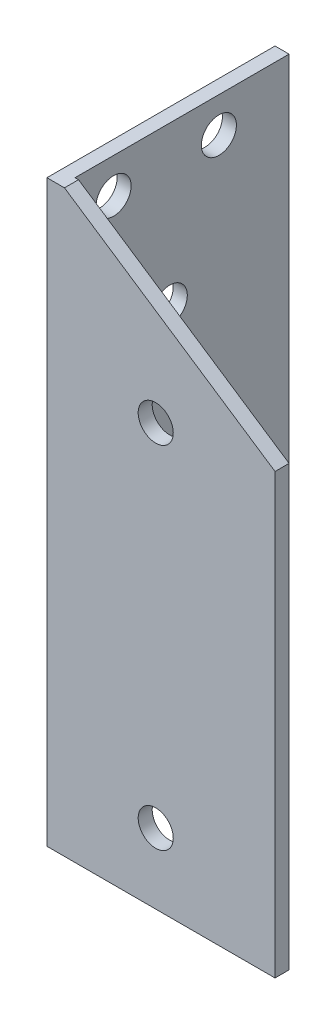
ISO-10303-21;
HEADER;
FILE_DESCRIPTION(('STEP AP214'),'2;1');
FILE_NAME('part.step','',(''),(''),'','','');
FILE_SCHEMA(('AUTOMOTIVE_DESIGN { 1 0 10303 214 1 1 1 1 }'));
ENDSEC;
DATA;
#1=APPLICATION_CONTEXT('core data for automotive mechanical design processes');
#2=APPLICATION_PROTOCOL_DEFINITION('international standard','automotive_design',2000,#1);
#3=PRODUCT_CONTEXT('',#1,'mechanical');
#4=PRODUCT('Part','Part','',(#3));
#5=PRODUCT_RELATED_PRODUCT_CATEGORY('part','',(#4));
#6=PRODUCT_DEFINITION_FORMATION('','',#4);
#7=PRODUCT_DEFINITION_CONTEXT('part definition',#1,'design');
#8=PRODUCT_DEFINITION('design','',#6,#7);
#9=PRODUCT_DEFINITION_SHAPE('','',#8);
#10=(LENGTH_UNIT() NAMED_UNIT(*) SI_UNIT(.MILLI.,.METRE.));
#11=(NAMED_UNIT(*) PLANE_ANGLE_UNIT() SI_UNIT($,.RADIAN.));
#12=(NAMED_UNIT(*) SI_UNIT($,.STERADIAN.) SOLID_ANGLE_UNIT());
#13=UNCERTAINTY_MEASURE_WITH_UNIT(LENGTH_MEASURE(1.E-05),#10,'distance_accuracy_value','');
#14=(GEOMETRIC_REPRESENTATION_CONTEXT(3) GLOBAL_UNCERTAINTY_ASSIGNED_CONTEXT((#13)) GLOBAL_UNIT_ASSIGNED_CONTEXT((#10,
#11,#12)) REPRESENTATION_CONTEXT('',''));
#15=CARTESIAN_POINT('',(0.,0.,0.));
#16=DIRECTION('',(0.,0.,1.));
#17=DIRECTION('',(1.,0.,0.));
#18=AXIS2_PLACEMENT_3D('',#15,#16,#17);
#19=CARTESIAN_POINT('',(4.,165.,0.));
#20=DIRECTION('',(-1.,0.,0.));
#21=DIRECTION('',(0.,0.,1.));
#22=AXIS2_PLACEMENT_3D('',#19,#20,#21);
#23=PLANE('',#22);
#24=CARTESIAN_POINT('',(4.,20.,-30.9999999999947));
#25=DIRECTION('',(-1.,0.,0.));
#26=DIRECTION('',(0.,0.,1.));
#27=AXIS2_PLACEMENT_3D('',#24,#25,#26);
#28=CIRCLE('',#27,4.99999999999998);
#29=CARTESIAN_POINT('',(4.,20.,-25.9999999999947));
#30=VERTEX_POINT('',#29);
#31=EDGE_CURVE('E199',#30,#30,#28,.T.);
#32=ORIENTED_EDGE('',*,*,#31,.T.);
#33=EDGE_LOOP('',(#32));
#34=FACE_BOUND('',#33,.T.);
#35=CARTESIAN_POINT('',(4.,155.,-15.));
#36=DIRECTION('',(-1.,0.,0.));
#37=DIRECTION('',(0.,0.,1.));
#38=AXIS2_PLACEMENT_3D('',#35,#36,#37);
#39=CIRCLE('',#38,5.);
#40=CARTESIAN_POINT('',(4.,155.,-10.));
#41=VERTEX_POINT('',#40);
#42=EDGE_CURVE('E196',#41,#41,#39,.T.);
#43=ORIENTED_EDGE('',*,*,#42,.T.);
#44=EDGE_LOOP('',(#43));
#45=FACE_BOUND('',#44,.T.);
#46=CARTESIAN_POINT('',(4.,155.,-45.));
#47=DIRECTION('',(-1.,0.,0.));
#48=DIRECTION('',(0.,0.,1.));
#49=AXIS2_PLACEMENT_3D('',#46,#47,#48);
#50=CIRCLE('',#49,5.00000000000001);
#51=CARTESIAN_POINT('',(4.,155.,-40.));
#52=VERTEX_POINT('',#51);
#53=EDGE_CURVE('E188',#52,#52,#50,.T.);
#54=ORIENTED_EDGE('',*,*,#53,.T.);
#55=EDGE_LOOP('',(#54));
#56=FACE_BOUND('',#55,.T.);
#57=CARTESIAN_POINT('',(4.,120.,-31.));
#58=DIRECTION('',(-1.,0.,0.));
#59=DIRECTION('',(0.,0.,1.));
#60=AXIS2_PLACEMENT_3D('',#57,#58,#59);
#61=CIRCLE('',#60,4.99999999999999);
#62=CARTESIAN_POINT('',(4.,120.,-26.));
#63=VERTEX_POINT('',#62);
#64=EDGE_CURVE('E158',#63,#63,#61,.T.);
#65=ORIENTED_EDGE('',*,*,#64,.T.);
#66=EDGE_LOOP('',(#65));
#67=FACE_BOUND('',#66,.T.);
#68=DIRECTION('',(0.,0.,-1.));
#69=VECTOR('',#68,1.);
#70=CARTESIAN_POINT('',(4.,0.,0.));
#71=LINE('',#70,#69);
#72=CARTESIAN_POINT('',(4.,0.,-4.));
#73=VERTEX_POINT('',#72);
#74=CARTESIAN_POINT('',(4.,0.,-65.));
#75=VERTEX_POINT('',#74);
#76=EDGE_CURVE('E122',#73,#75,#71,.T.);
#77=ORIENTED_EDGE('',*,*,#76,.T.);
#78=DIRECTION('',(0.,-1.,0.));
#79=VECTOR('',#78,1.);
#80=CARTESIAN_POINT('',(4.,165.,-65.));
#81=LINE('',#80,#79);
#82=CARTESIAN_POINT('',(4.,165.,-65.));
#83=VERTEX_POINT('',#82);
#84=EDGE_CURVE('E41',#83,#75,#81,.T.);
#85=ORIENTED_EDGE('',*,*,#84,.F.);
#86=DIRECTION('',(0.,0.,-1.));
#87=VECTOR('',#86,1.);
#88=CARTESIAN_POINT('',(4.,165.,0.));
#89=LINE('',#88,#87);
#90=CARTESIAN_POINT('',(4.,165.,-4.));
#91=VERTEX_POINT('',#90);
#92=EDGE_CURVE('E87',#91,#83,#89,.T.);
#93=ORIENTED_EDGE('',*,*,#92,.F.);
#94=DIRECTION('',(0.,-1.,0.));
#95=VECTOR('',#94,1.);
#96=CARTESIAN_POINT('',(4.,165.,-4.));
#97=LINE('',#96,#95);
#98=EDGE_CURVE('E116',#91,#73,#97,.T.);
#99=ORIENTED_EDGE('',*,*,#98,.T.);
#100=EDGE_LOOP('',(#77,#85,#93,#99));
#101=FACE_BOUND('',#100,.T.);
#102=ADVANCED_FACE('F34',(#34,#45,#56,#67,#101),#23,.F.);
#103=CARTESIAN_POINT('',(0.,165.,-65.));
#104=DIRECTION('',(0.,0.,-1.));
#105=DIRECTION('',(-1.,0.,0.));
#106=AXIS2_PLACEMENT_3D('',#103,#104,#105);
#107=PLANE('',#106);
#108=DIRECTION('',(1.,0.,0.));
#109=VECTOR('',#108,1.);
#110=CARTESIAN_POINT('',(0.,0.,-65.));
#111=LINE('',#110,#109);
#112=CARTESIAN_POINT('',(0.,0.,-65.));
#113=VERTEX_POINT('',#112);
#114=EDGE_CURVE('E125',#113,#75,#111,.T.);
#115=ORIENTED_EDGE('',*,*,#114,.F.);
#116=DIRECTION('',(0.,-1.,0.));
#117=VECTOR('',#116,1.);
#118=CARTESIAN_POINT('',(0.,165.,-65.));
#119=LINE('',#118,#117);
#120=CARTESIAN_POINT('',(0.,165.,-65.));
#121=VERTEX_POINT('',#120);
#122=EDGE_CURVE('E145',#121,#113,#119,.T.);
#123=ORIENTED_EDGE('',*,*,#122,.F.);
#124=DIRECTION('',(1.,0.,0.));
#125=VECTOR('',#124,1.);
#126=CARTESIAN_POINT('',(0.,165.,-65.));
#127=LINE('',#126,#125);
#128=EDGE_CURVE('E118',#121,#83,#127,.T.);
#129=ORIENTED_EDGE('',*,*,#128,.T.);
#130=ORIENTED_EDGE('',*,*,#84,.T.);
#131=EDGE_LOOP('',(#115,#123,#129,#130));
#132=FACE_BOUND('',#131,.T.);
#133=ADVANCED_FACE('F170',(#132),#107,.T.);
#134=CARTESIAN_POINT('',(0.,165.,0.));
#135=DIRECTION('',(-1.,0.,0.));
#136=DIRECTION('',(0.,0.,1.));
#137=AXIS2_PLACEMENT_3D('',#134,#135,#136);
#138=PLANE('',#137);
#139=CARTESIAN_POINT('',(0.,20.,-30.9999999999947));
#140=DIRECTION('',(-1.,0.,0.));
#141=DIRECTION('',(0.,0.,1.));
#142=AXIS2_PLACEMENT_3D('',#139,#140,#141);
#143=CIRCLE('',#142,4.99999999999998);
#144=CARTESIAN_POINT('',(0.,20.,-25.9999999999947));
#145=VERTEX_POINT('',#144);
#146=EDGE_CURVE('E185',#145,#145,#143,.T.);
#147=ORIENTED_EDGE('',*,*,#146,.F.);
#148=EDGE_LOOP('',(#147));
#149=FACE_BOUND('',#148,.T.);
#150=CARTESIAN_POINT('',(0.,155.,-15.));
#151=DIRECTION('',(-1.,0.,0.));
#152=DIRECTION('',(0.,0.,1.));
#153=AXIS2_PLACEMENT_3D('',#150,#151,#152);
#154=CIRCLE('',#153,5.);
#155=CARTESIAN_POINT('',(0.,155.,-10.));
#156=VERTEX_POINT('',#155);
#157=EDGE_CURVE('E189',#156,#156,#154,.T.);
#158=ORIENTED_EDGE('',*,*,#157,.F.);
#159=EDGE_LOOP('',(#158));
#160=FACE_BOUND('',#159,.T.);
#161=CARTESIAN_POINT('',(0.,155.,-45.));
#162=DIRECTION('',(-1.,0.,0.));
#163=DIRECTION('',(0.,0.,1.));
#164=AXIS2_PLACEMENT_3D('',#161,#162,#163);
#165=CIRCLE('',#164,5.00000000000001);
#166=CARTESIAN_POINT('',(0.,155.,-40.));
#167=VERTEX_POINT('',#166);
#168=EDGE_CURVE('E182',#167,#167,#165,.T.);
#169=ORIENTED_EDGE('',*,*,#168,.F.);
#170=EDGE_LOOP('',(#169));
#171=FACE_BOUND('',#170,.T.);
#172=CARTESIAN_POINT('',(0.,120.,-31.));
#173=DIRECTION('',(-1.,0.,0.));
#174=DIRECTION('',(0.,0.,1.));
#175=AXIS2_PLACEMENT_3D('',#172,#173,#174);
#176=CIRCLE('',#175,4.99999999999999);
#177=CARTESIAN_POINT('',(0.,120.,-26.));
#178=VERTEX_POINT('',#177);
#179=EDGE_CURVE('E163',#178,#178,#176,.T.);
#180=ORIENTED_EDGE('',*,*,#179,.F.);
#181=EDGE_LOOP('',(#180));
#182=FACE_BOUND('',#181,.T.);
#183=DIRECTION('',(0.,0.,-1.));
#184=VECTOR('',#183,1.);
#185=CARTESIAN_POINT('',(0.,0.,0.));
#186=LINE('',#185,#184);
#187=CARTESIAN_POINT('',(0.,0.,0.));
#188=VERTEX_POINT('',#187);
#189=EDGE_CURVE('E129',#188,#113,#186,.T.);
#190=ORIENTED_EDGE('',*,*,#189,.F.);
#191=DIRECTION('',(0.,-1.,0.));
#192=VECTOR('',#191,1.);
#193=CARTESIAN_POINT('',(0.,165.,0.));
#194=LINE('',#193,#192);
#195=CARTESIAN_POINT('',(0.,165.,0.));
#196=VERTEX_POINT('',#195);
#197=EDGE_CURVE('E143',#196,#188,#194,.T.);
#198=ORIENTED_EDGE('',*,*,#197,.F.);
#199=DIRECTION('',(0.,0.,-1.));
#200=VECTOR('',#199,1.);
#201=CARTESIAN_POINT('',(0.,165.,0.));
#202=LINE('',#201,#200);
#203=EDGE_CURVE('E114',#196,#121,#202,.T.);
#204=ORIENTED_EDGE('',*,*,#203,.T.);
#205=ORIENTED_EDGE('',*,*,#122,.T.);
#206=EDGE_LOOP('',(#190,#198,#204,#205));
#207=FACE_BOUND('',#206,.T.);
#208=ADVANCED_FACE('F173',(#149,#160,#171,#182,#207),#138,.T.);
#209=CARTESIAN_POINT('',(0.,165.,0.));
#210=DIRECTION('',(0.,0.,1.));
#211=DIRECTION('',(1.,0.,0.));
#212=AXIS2_PLACEMENT_3D('',#209,#210,#211);
#213=PLANE('',#212);
#214=DIRECTION('',(0.832050294337844,-0.554700196225229,0.));
#215=VECTOR('',#214,1.);
#216=CARTESIAN_POINT('',(5.00000000000001,165.,0.));
#217=LINE('',#216,#215);
#218=CARTESIAN_POINT('',(5.00000000000001,165.,0.));
#219=VERTEX_POINT('',#218);
#220=CARTESIAN_POINT('',(65.,125.,0.));
#221=VERTEX_POINT('',#220);
#222=EDGE_CURVE('E98',#219,#221,#217,.T.);
#223=ORIENTED_EDGE('',*,*,#222,.F.);
#224=DIRECTION('',(-1.,0.,0.));
#225=VECTOR('',#224,1.);
#226=CARTESIAN_POINT('',(0.,165.,0.));
#227=LINE('',#226,#225);
#228=EDGE_CURVE('E105',#219,#196,#227,.T.);
#229=ORIENTED_EDGE('',*,*,#228,.T.);
#230=ORIENTED_EDGE('',*,*,#197,.T.);
#231=DIRECTION('',(-1.,0.,0.));
#232=VECTOR('',#231,1.);
#233=CARTESIAN_POINT('',(0.,0.,0.));
#234=LINE('',#233,#232);
#235=CARTESIAN_POINT('',(65.,0.,0.));
#236=VERTEX_POINT('',#235);
#237=EDGE_CURVE('E132',#236,#188,#234,.T.);
#238=ORIENTED_EDGE('',*,*,#237,.F.);
#239=DIRECTION('',(0.,-1.,0.));
#240=VECTOR('',#239,1.);
#241=CARTESIAN_POINT('',(65.,165.,0.));
#242=LINE('',#241,#240);
#243=EDGE_CURVE('E108',#221,#236,#242,.T.);
#244=ORIENTED_EDGE('',*,*,#243,.F.);
#245=EDGE_LOOP('',(#223,#229,#230,#238,#244));
#246=FACE_BOUND('',#245,.T.);
#247=CARTESIAN_POINT('',(31.0000000000053,20.,0.));
#248=DIRECTION('',(0.,0.,1.));
#249=DIRECTION('',(1.,0.,0.));
#250=AXIS2_PLACEMENT_3D('',#247,#248,#249);
#251=CIRCLE('',#250,5.00000000000001);
#252=CARTESIAN_POINT('',(36.0000000000053,20.,0.));
#253=VERTEX_POINT('',#252);
#254=EDGE_CURVE('E152',#253,#253,#251,.T.);
#255=ORIENTED_EDGE('',*,*,#254,.F.);
#256=EDGE_LOOP('',(#255));
#257=FACE_BOUND('',#256,.T.);
#258=CARTESIAN_POINT('',(31.,120.,0.));
#259=DIRECTION('',(0.,0.,1.));
#260=DIRECTION('',(1.,0.,0.));
#261=AXIS2_PLACEMENT_3D('',#258,#259,#260);
#262=CIRCLE('',#261,4.99999999999999);
#263=CARTESIAN_POINT('',(36.,120.,0.));
#264=VERTEX_POINT('',#263);
#265=EDGE_CURVE('E149',#264,#264,#262,.T.);
#266=ORIENTED_EDGE('',*,*,#265,.F.);
#267=EDGE_LOOP('',(#266));
#268=FACE_BOUND('',#267,.T.);
#269=ADVANCED_FACE('F103',(#246,#257,#268),#213,.T.);
#270=CARTESIAN_POINT('',(65.,165.,-4.));
#271=DIRECTION('',(1.,0.,0.));
#272=DIRECTION('',(0.,0.,-1.));
#273=AXIS2_PLACEMENT_3D('',#270,#271,#272);
#274=PLANE('',#273);
#275=DIRECTION('',(0.,0.,1.));
#276=VECTOR('',#275,1.);
#277=CARTESIAN_POINT('',(65.,125.,-65.));
#278=LINE('',#277,#276);
#279=CARTESIAN_POINT('',(65.,125.,-4.));
#280=VERTEX_POINT('',#279);
#281=EDGE_CURVE('E109',#280,#221,#278,.T.);
#282=ORIENTED_EDGE('',*,*,#281,.T.);
#283=ORIENTED_EDGE('',*,*,#243,.T.);
#284=DIRECTION('',(0.,0.,1.));
#285=VECTOR('',#284,1.);
#286=CARTESIAN_POINT('',(65.,0.,-4.));
#287=LINE('',#286,#285);
#288=CARTESIAN_POINT('',(65.,0.,-4.));
#289=VERTEX_POINT('',#288);
#290=EDGE_CURVE('E135',#289,#236,#287,.T.);
#291=ORIENTED_EDGE('',*,*,#290,.F.);
#292=DIRECTION('',(0.,-1.,0.));
#293=VECTOR('',#292,1.);
#294=CARTESIAN_POINT('',(65.,165.,-4.));
#295=LINE('',#294,#293);
#296=EDGE_CURVE('E140',#280,#289,#295,.T.);
#297=ORIENTED_EDGE('',*,*,#296,.F.);
#298=EDGE_LOOP('',(#282,#283,#291,#297));
#299=FACE_BOUND('',#298,.T.);
#300=ADVANCED_FACE('F180',(#299),#274,.T.);
#301=CARTESIAN_POINT('',(0.,165.,-4.));
#302=DIRECTION('',(0.,0.,1.));
#303=DIRECTION('',(1.,0.,0.));
#304=AXIS2_PLACEMENT_3D('',#301,#302,#303);
#305=PLANE('',#304);
#306=CARTESIAN_POINT('',(31.0000000000053,20.,-4.));
#307=DIRECTION('',(0.,0.,1.));
#308=DIRECTION('',(1.,0.,0.));
#309=AXIS2_PLACEMENT_3D('',#306,#307,#308);
#310=CIRCLE('',#309,5.00000000000001);
#311=CARTESIAN_POINT('',(36.0000000000053,20.,-4.));
#312=VERTEX_POINT('',#311);
#313=EDGE_CURVE('E150',#312,#312,#310,.T.);
#314=ORIENTED_EDGE('',*,*,#313,.T.);
#315=EDGE_LOOP('',(#314));
#316=FACE_BOUND('',#315,.T.);
#317=CARTESIAN_POINT('',(31.,120.,-4.));
#318=DIRECTION('',(0.,0.,1.));
#319=DIRECTION('',(1.,0.,0.));
#320=AXIS2_PLACEMENT_3D('',#317,#318,#319);
#321=CIRCLE('',#320,4.99999999999999);
#322=CARTESIAN_POINT('',(36.,120.,-4.));
#323=VERTEX_POINT('',#322);
#324=EDGE_CURVE('E126',#323,#323,#321,.T.);
#325=ORIENTED_EDGE('',*,*,#324,.T.);
#326=EDGE_LOOP('',(#325));
#327=FACE_BOUND('',#326,.T.);
#328=DIRECTION('',(1.,0.,0.));
#329=VECTOR('',#328,1.);
#330=CARTESIAN_POINT('',(0.,165.,-4.));
#331=LINE('',#330,#329);
#332=CARTESIAN_POINT('',(5.00000000000001,165.,-4.));
#333=VERTEX_POINT('',#332);
#334=EDGE_CURVE('E55',#333,#91,#331,.F.);
#335=ORIENTED_EDGE('',*,*,#334,.F.);
#336=DIRECTION('',(0.832050294337844,-0.554700196225229,0.));
#337=VECTOR('',#336,1.);
#338=CARTESIAN_POINT('',(1.53846153846154,167.307692307692,-4.));
#339=LINE('',#338,#337);
#340=EDGE_CURVE('E48',#333,#280,#339,.T.);
#341=ORIENTED_EDGE('',*,*,#340,.T.);
#342=ORIENTED_EDGE('',*,*,#296,.T.);
#343=DIRECTION('',(1.,0.,0.));
#344=VECTOR('',#343,1.);
#345=CARTESIAN_POINT('',(0.,0.,-4.));
#346=LINE('',#345,#344);
#347=EDGE_CURVE('E82',#289,#73,#346,.F.);
#348=ORIENTED_EDGE('',*,*,#347,.T.);
#349=ORIENTED_EDGE('',*,*,#98,.F.);
#350=EDGE_LOOP('',(#335,#341,#342,#348,#349));
#351=FACE_BOUND('',#350,.T.);
#352=ADVANCED_FACE('F229',(#316,#327,#351),#305,.F.);
#353=CARTESIAN_POINT('',(0.,165.,0.));
#354=DIRECTION('',(0.,-1.,0.));
#355=DIRECTION('',(-1.,0.,0.));
#356=AXIS2_PLACEMENT_3D('',#353,#354,#355);
#357=PLANE('',#356);
#358=ORIENTED_EDGE('',*,*,#228,.F.);
#359=DIRECTION('',(0.,0.,-1.));
#360=VECTOR('',#359,1.);
#361=CARTESIAN_POINT('',(5.00000000000001,165.,0.));
#362=LINE('',#361,#360);
#363=EDGE_CURVE('E11',#219,#333,#362,.T.);
#364=ORIENTED_EDGE('',*,*,#363,.T.);
#365=ORIENTED_EDGE('',*,*,#334,.T.);
#366=ORIENTED_EDGE('',*,*,#92,.T.);
#367=ORIENTED_EDGE('',*,*,#128,.F.);
#368=ORIENTED_EDGE('',*,*,#203,.F.);
#369=EDGE_LOOP('',(#358,#364,#365,#366,#367,#368));
#370=FACE_BOUND('',#369,.T.);
#371=ADVANCED_FACE('F112',(#370),#357,.F.);
#372=CARTESIAN_POINT('',(0.,0.,0.));
#373=DIRECTION('',(0.,-1.,0.));
#374=DIRECTION('',(-1.,0.,0.));
#375=AXIS2_PLACEMENT_3D('',#372,#373,#374);
#376=PLANE('',#375);
#377=ORIENTED_EDGE('',*,*,#76,.F.);
#378=ORIENTED_EDGE('',*,*,#347,.F.);
#379=ORIENTED_EDGE('',*,*,#290,.T.);
#380=ORIENTED_EDGE('',*,*,#237,.T.);
#381=ORIENTED_EDGE('',*,*,#189,.T.);
#382=ORIENTED_EDGE('',*,*,#114,.T.);
#383=EDGE_LOOP('',(#377,#378,#379,#380,#381,#382));
#384=FACE_BOUND('',#383,.T.);
#385=ADVANCED_FACE('F177',(#384),#376,.T.);
#386=CARTESIAN_POINT('',(31.,120.,-10.));
#387=DIRECTION('',(0.,0.,1.));
#388=DIRECTION('',(1.,0.,0.));
#389=AXIS2_PLACEMENT_3D('',#386,#387,#388);
#390=CYLINDRICAL_SURFACE('',#389,4.99999999999999);
#391=ORIENTED_EDGE('',*,*,#265,.T.);
#392=EDGE_LOOP('',(#391));
#393=FACE_BOUND('',#392,.T.);
#394=ORIENTED_EDGE('',*,*,#324,.F.);
#395=EDGE_LOOP('',(#394));
#396=FACE_BOUND('',#395,.T.);
#397=ADVANCED_FACE('F241',(#393,#396),#390,.F.);
#398=CARTESIAN_POINT('',(31.0000000000053,20.,-10.));
#399=DIRECTION('',(0.,0.,1.));
#400=DIRECTION('',(1.,0.,0.));
#401=AXIS2_PLACEMENT_3D('',#398,#399,#400);
#402=CYLINDRICAL_SURFACE('',#401,5.00000000000001);
#403=ORIENTED_EDGE('',*,*,#254,.T.);
#404=EDGE_LOOP('',(#403));
#405=FACE_BOUND('',#404,.T.);
#406=ORIENTED_EDGE('',*,*,#313,.F.);
#407=EDGE_LOOP('',(#406));
#408=FACE_BOUND('',#407,.T.);
#409=ADVANCED_FACE('F245',(#405,#408),#402,.F.);
#410=CARTESIAN_POINT('',(10.,120.,-31.));
#411=DIRECTION('',(-1.,0.,0.));
#412=DIRECTION('',(0.,0.,1.));
#413=AXIS2_PLACEMENT_3D('',#410,#411,#412);
#414=CYLINDRICAL_SURFACE('',#413,4.99999999999999);
#415=ORIENTED_EDGE('',*,*,#179,.T.);
#416=EDGE_LOOP('',(#415));
#417=FACE_BOUND('',#416,.T.);
#418=ORIENTED_EDGE('',*,*,#64,.F.);
#419=EDGE_LOOP('',(#418));
#420=FACE_BOUND('',#419,.T.);
#421=ADVANCED_FACE('F204',(#417,#420),#414,.F.);
#422=CARTESIAN_POINT('',(10.,155.,-45.));
#423=DIRECTION('',(-1.,0.,0.));
#424=DIRECTION('',(0.,0.,1.));
#425=AXIS2_PLACEMENT_3D('',#422,#423,#424);
#426=CYLINDRICAL_SURFACE('',#425,5.00000000000001);
#427=ORIENTED_EDGE('',*,*,#168,.T.);
#428=EDGE_LOOP('',(#427));
#429=FACE_BOUND('',#428,.T.);
#430=ORIENTED_EDGE('',*,*,#53,.F.);
#431=EDGE_LOOP('',(#430));
#432=FACE_BOUND('',#431,.T.);
#433=ADVANCED_FACE('F251',(#429,#432),#426,.F.);
#434=CARTESIAN_POINT('',(10.,155.,-15.));
#435=DIRECTION('',(-1.,0.,0.));
#436=DIRECTION('',(0.,0.,1.));
#437=AXIS2_PLACEMENT_3D('',#434,#435,#436);
#438=CYLINDRICAL_SURFACE('',#437,5.);
#439=ORIENTED_EDGE('',*,*,#157,.T.);
#440=EDGE_LOOP('',(#439));
#441=FACE_BOUND('',#440,.T.);
#442=ORIENTED_EDGE('',*,*,#42,.F.);
#443=EDGE_LOOP('',(#442));
#444=FACE_BOUND('',#443,.T.);
#445=ADVANCED_FACE('F254',(#441,#444),#438,.F.);
#446=CARTESIAN_POINT('',(10.,20.,-30.9999999999947));
#447=DIRECTION('',(-1.,0.,0.));
#448=DIRECTION('',(0.,0.,1.));
#449=AXIS2_PLACEMENT_3D('',#446,#447,#448);
#450=CYLINDRICAL_SURFACE('',#449,4.99999999999998);
#451=ORIENTED_EDGE('',*,*,#146,.T.);
#452=EDGE_LOOP('',(#451));
#453=FACE_BOUND('',#452,.T.);
#454=ORIENTED_EDGE('',*,*,#31,.F.);
#455=EDGE_LOOP('',(#454));
#456=FACE_BOUND('',#455,.T.);
#457=ADVANCED_FACE('F258',(#453,#456),#450,.F.);
#458=CARTESIAN_POINT('',(5.00000000000001,165.,-65.));
#459=DIRECTION('',(-0.554700196225229,-0.832050294337844,0.));
#460=DIRECTION('',(0.832050294337844,-0.554700196225229,0.));
#461=AXIS2_PLACEMENT_3D('',#458,#459,#460);
#462=PLANE('',#461);
#463=ORIENTED_EDGE('',*,*,#363,.F.);
#464=ORIENTED_EDGE('',*,*,#222,.T.);
#465=ORIENTED_EDGE('',*,*,#281,.F.);
#466=ORIENTED_EDGE('',*,*,#340,.F.);
#467=EDGE_LOOP('',(#463,#464,#465,#466));
#468=FACE_BOUND('',#467,.T.);
#469=ADVANCED_FACE('F97',(#468),#462,.F.);
#470=CLOSED_SHELL('',(#102,#133,#208,#269,#300,#352,#371,#385,#397,#409,#421,#433,#445,#457,#469));
#471=MANIFOLD_SOLID_BREP('B2',#470);
#472=ADVANCED_BREP_SHAPE_REPRESENTATION('',(#18,#471),#14);
#473=SHAPE_DEFINITION_REPRESENTATION(#9,#472);
ENDSEC;
END-ISO-10303-21;
